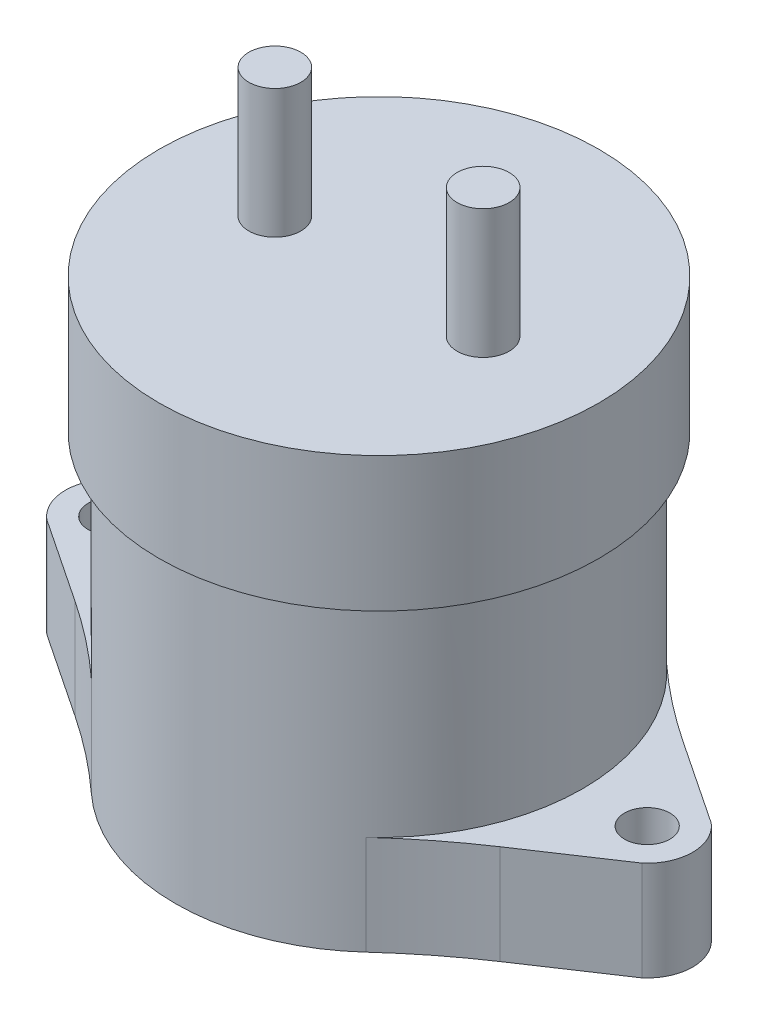
ISO-10303-21;
HEADER;
FILE_DESCRIPTION(('STEP AP214'),'2;1');
FILE_NAME('part.step','',(''),(''),'','','');
FILE_SCHEMA(('AUTOMOTIVE_DESIGN { 1 0 10303 214 1 1 1 1 }'));
ENDSEC;
DATA;
#1=APPLICATION_CONTEXT('core data for automotive mechanical design processes');
#2=APPLICATION_PROTOCOL_DEFINITION('international standard','automotive_design',2000,#1);
#3=PRODUCT_CONTEXT('',#1,'mechanical');
#4=PRODUCT('Part','Part','',(#3));
#5=PRODUCT_RELATED_PRODUCT_CATEGORY('part','',(#4));
#6=PRODUCT_DEFINITION_FORMATION('','',#4);
#7=PRODUCT_DEFINITION_CONTEXT('part definition',#1,'design');
#8=PRODUCT_DEFINITION('design','',#6,#7);
#9=PRODUCT_DEFINITION_SHAPE('','',#8);
#10=(LENGTH_UNIT() NAMED_UNIT(*) SI_UNIT(.MILLI.,.METRE.));
#11=(NAMED_UNIT(*) PLANE_ANGLE_UNIT() SI_UNIT($,.RADIAN.));
#12=(NAMED_UNIT(*) SI_UNIT($,.STERADIAN.) SOLID_ANGLE_UNIT());
#13=UNCERTAINTY_MEASURE_WITH_UNIT(LENGTH_MEASURE(1.E-05),#10,'distance_accuracy_value','');
#14=(GEOMETRIC_REPRESENTATION_CONTEXT(3) GLOBAL_UNCERTAINTY_ASSIGNED_CONTEXT((#13)) GLOBAL_UNIT_ASSIGNED_CONTEXT((#10,
#11,#12)) REPRESENTATION_CONTEXT('',''));
#15=CARTESIAN_POINT('',(0.,0.,0.));
#16=DIRECTION('',(0.,0.,1.));
#17=DIRECTION('',(1.,0.,0.));
#18=AXIS2_PLACEMENT_3D('',#15,#16,#17);
#19=CARTESIAN_POINT('',(0.,14.2,0.));
#20=DIRECTION('',(0.,-1.,0.));
#21=DIRECTION('',(0.,0.,-1.));
#22=AXIS2_PLACEMENT_3D('',#19,#20,#21);
#23=CYLINDRICAL_SURFACE('',#22,26.);
#24=CARTESIAN_POINT('',(0.,12.7,0.));
#25=DIRECTION('',(0.,1.,0.));
#26=DIRECTION('',(0.,0.,1.));
#27=AXIS2_PLACEMENT_3D('',#24,#25,#26);
#28=CIRCLE('',#27,26.);
#29=CARTESIAN_POINT('',(-17.5450875411044,12.7,-19.1877539898495));
#30=VERTEX_POINT('',#29);
#31=CARTESIAN_POINT('',(-17.5450875411043,12.7,19.1877539898495));
#32=VERTEX_POINT('',#31);
#33=EDGE_CURVE('E47',#30,#32,#28,.T.);
#34=ORIENTED_EDGE('',*,*,#33,.T.);
#35=DIRECTION('',(0.,-1.,0.));
#36=VECTOR('',#35,1.);
#37=CARTESIAN_POINT('',(-17.5450875411043,12.7,19.1877539898495));
#38=LINE('',#37,#36);
#39=CARTESIAN_POINT('',(-17.5450875411043,0.,19.1877539898495));
#40=VERTEX_POINT('',#39);
#41=EDGE_CURVE('E215',#32,#40,#38,.T.);
#42=ORIENTED_EDGE('',*,*,#41,.T.);
#43=CARTESIAN_POINT('',(0.,0.,0.));
#44=DIRECTION('',(0.,1.,0.));
#45=DIRECTION('',(0.,0.,1.));
#46=AXIS2_PLACEMENT_3D('',#43,#44,#45);
#47=CIRCLE('',#46,26.);
#48=CARTESIAN_POINT('',(17.5450875411043,0.,19.1877539898495));
#49=VERTEX_POINT('',#48);
#50=EDGE_CURVE('E205',#40,#49,#47,.T.);
#51=ORIENTED_EDGE('',*,*,#50,.T.);
#52=DIRECTION('',(0.,-1.,0.));
#53=VECTOR('',#52,1.);
#54=CARTESIAN_POINT('',(17.5450875411043,12.7,19.1877539898495));
#55=LINE('',#54,#53);
#56=CARTESIAN_POINT('',(17.5450875411044,12.7,19.1877539898495));
#57=VERTEX_POINT('',#56);
#58=EDGE_CURVE('E218',#57,#49,#55,.T.);
#59=ORIENTED_EDGE('',*,*,#58,.F.);
#60=CARTESIAN_POINT('',(17.5450875411044,12.7,-19.1877539898495));
#61=VERTEX_POINT('',#60);
#62=EDGE_CURVE('E11',#57,#61,#28,.T.);
#63=ORIENTED_EDGE('',*,*,#62,.T.);
#64=DIRECTION('',(0.,-1.,0.));
#65=VECTOR('',#64,1.);
#66=CARTESIAN_POINT('',(17.5450875411044,12.7,-19.1877539898495));
#67=LINE('',#66,#65);
#68=CARTESIAN_POINT('',(17.5450875411044,0.,-19.1877539898495));
#69=VERTEX_POINT('',#68);
#70=EDGE_CURVE('E149',#61,#69,#67,.T.);
#71=ORIENTED_EDGE('',*,*,#70,.T.);
#72=CARTESIAN_POINT('',(-17.5450875411044,0.,-19.1877539898495));
#73=VERTEX_POINT('',#72);
#74=EDGE_CURVE('E225',#69,#73,#47,.T.);
#75=ORIENTED_EDGE('',*,*,#74,.T.);
#76=DIRECTION('',(0.,-1.,0.));
#77=VECTOR('',#76,1.);
#78=CARTESIAN_POINT('',(-17.5450875411044,12.7,-19.1877539898495));
#79=LINE('',#78,#77);
#80=EDGE_CURVE('E59',#30,#73,#79,.T.);
#81=ORIENTED_EDGE('',*,*,#80,.F.);
#82=EDGE_LOOP('',(#34,#42,#51,#59,#63,#71,#75,#81));
#83=FACE_BOUND('',#82,.T.);
#84=CARTESIAN_POINT('',(0.,39.2,0.));
#85=DIRECTION('',(0.,1.,0.));
#86=DIRECTION('',(0.,0.,1.));
#87=AXIS2_PLACEMENT_3D('',#84,#85,#86);
#88=CIRCLE('',#87,26.);
#89=CARTESIAN_POINT('',(0.,39.2,26.));
#90=VERTEX_POINT('',#89);
#91=EDGE_CURVE('E318',#90,#90,#88,.T.);
#92=ORIENTED_EDGE('',*,*,#91,.F.);
#93=EDGE_LOOP('',(#92));
#94=FACE_BOUND('',#93,.T.);
#95=ADVANCED_FACE('F40',(#83,#94),#23,.T.);
#96=CARTESIAN_POINT('',(0.,0.,0.));
#97=DIRECTION('',(0.,1.,0.));
#98=DIRECTION('',(0.,0.,1.));
#99=AXIS2_PLACEMENT_3D('',#96,#97,#98);
#100=PLANE('',#99);
#101=ORIENTED_EDGE('',*,*,#74,.F.);
#102=CARTESIAN_POINT('',(71.5299722829639,0.,-78.2269970355402));
#103=DIRECTION('',(0.,1.,0.));
#104=DIRECTION('',(0.,0.,1.));
#105=AXIS2_PLACEMENT_3D('',#102,#103,#104);
#106=CIRCLE('',#105,80.);
#107=CARTESIAN_POINT('',(27.1290840899181,0.,-11.679561865816));
#108=VERTEX_POINT('',#107);
#109=EDGE_CURVE('E180',#69,#108,#106,.T.);
#110=ORIENTED_EDGE('',*,*,#109,.T.);
#111=DIRECTION('',(0.831842939621553,0.,0.555011102413072));
#112=VECTOR('',#111,1.);
#113=CARTESIAN_POINT('',(27.1290840899181,0.,-11.679561865816));
#114=LINE('',#113,#112);
#115=CARTESIAN_POINT('',(37.9900889738865,0.,-4.43302768628988));
#116=VERTEX_POINT('',#115);
#117=EDGE_CURVE('E131',#108,#116,#114,.T.);
#118=ORIENTED_EDGE('',*,*,#117,.T.);
#119=CARTESIAN_POINT('',(34.25,0.,0.));
#120=DIRECTION('',(0.,-1.,0.));
#121=DIRECTION('',(0.,0.,-1.));
#122=AXIS2_PLACEMENT_3D('',#119,#120,#121);
#123=CIRCLE('',#122,5.8);
#124=CARTESIAN_POINT('',(37.9900889738865,0.,4.43302768628989));
#125=VERTEX_POINT('',#124);
#126=EDGE_CURVE('E184',#116,#125,#123,.T.);
#127=ORIENTED_EDGE('',*,*,#126,.T.);
#128=DIRECTION('',(-0.831842939621553,0.,0.555011102413072));
#129=VECTOR('',#128,1.);
#130=CARTESIAN_POINT('',(27.1290840899181,0.,11.679561865816));
#131=LINE('',#130,#129);
#132=CARTESIAN_POINT('',(27.1290840899181,0.,11.679561865816));
#133=VERTEX_POINT('',#132);
#134=EDGE_CURVE('E187',#125,#133,#131,.T.);
#135=ORIENTED_EDGE('',*,*,#134,.T.);
#136=CARTESIAN_POINT('',(71.5299722829638,0.,78.2269970355402));
#137=DIRECTION('',(0.,1.,0.));
#138=DIRECTION('',(0.,0.,-1.));
#139=AXIS2_PLACEMENT_3D('',#136,#137,#138);
#140=CIRCLE('',#139,80.);
#141=EDGE_CURVE('E190',#133,#49,#140,.T.);
#142=ORIENTED_EDGE('',*,*,#141,.T.);
#143=ORIENTED_EDGE('',*,*,#50,.F.);
#144=CARTESIAN_POINT('',(-71.5299722829638,0.,78.2269970355402));
#145=DIRECTION('',(0.,1.,0.));
#146=DIRECTION('',(0.,0.,1.));
#147=AXIS2_PLACEMENT_3D('',#144,#145,#146);
#148=CIRCLE('',#147,80.);
#149=CARTESIAN_POINT('',(-27.1290840899181,0.,11.679561865816));
#150=VERTEX_POINT('',#149);
#151=EDGE_CURVE('E193',#40,#150,#148,.T.);
#152=ORIENTED_EDGE('',*,*,#151,.T.);
#153=DIRECTION('',(-0.831842939621553,0.,-0.555011102413072));
#154=VECTOR('',#153,1.);
#155=CARTESIAN_POINT('',(-27.1290840899181,0.,11.679561865816));
#156=LINE('',#155,#154);
#157=CARTESIAN_POINT('',(-37.9900889738865,0.,4.43302768628989));
#158=VERTEX_POINT('',#157);
#159=EDGE_CURVE('E196',#150,#158,#156,.T.);
#160=ORIENTED_EDGE('',*,*,#159,.T.);
#161=CARTESIAN_POINT('',(-34.25,0.,0.));
#162=DIRECTION('',(0.,-1.,0.));
#163=DIRECTION('',(0.,0.,1.));
#164=AXIS2_PLACEMENT_3D('',#161,#162,#163);
#165=CIRCLE('',#164,5.8);
#166=CARTESIAN_POINT('',(-37.9900889738865,0.,-4.43302768628988));
#167=VERTEX_POINT('',#166);
#168=EDGE_CURVE('E199',#158,#167,#165,.T.);
#169=ORIENTED_EDGE('',*,*,#168,.T.);
#170=DIRECTION('',(0.831842939621553,0.,-0.555011102413072));
#171=VECTOR('',#170,1.);
#172=CARTESIAN_POINT('',(-27.1290840899181,0.,-11.679561865816));
#173=LINE('',#172,#171);
#174=CARTESIAN_POINT('',(-27.1290840899181,0.,-11.679561865816));
#175=VERTEX_POINT('',#174);
#176=EDGE_CURVE('E153',#167,#175,#173,.T.);
#177=ORIENTED_EDGE('',*,*,#176,.T.);
#178=CARTESIAN_POINT('',(-71.5299722829639,0.,-78.2269970355402));
#179=DIRECTION('',(0.,1.,0.));
#180=DIRECTION('',(0.,0.,-1.));
#181=AXIS2_PLACEMENT_3D('',#178,#179,#180);
#182=CIRCLE('',#181,80.);
#183=EDGE_CURVE('E150',#175,#73,#182,.T.);
#184=ORIENTED_EDGE('',*,*,#183,.T.);
#185=EDGE_LOOP('',(#101,#110,#118,#127,#135,#142,#143,#152,#160,#169,#177,#184));
#186=FACE_BOUND('',#185,.T.);
#187=CARTESIAN_POINT('',(-34.25,0.,0.));
#188=DIRECTION('',(0.,-1.,0.));
#189=DIRECTION('',(0.,0.,1.));
#190=AXIS2_PLACEMENT_3D('',#187,#188,#189);
#191=CIRCLE('',#190,2.9);
#192=CARTESIAN_POINT('',(-34.25,0.,2.9));
#193=VERTEX_POINT('',#192);
#194=EDGE_CURVE('E315',#193,#193,#191,.T.);
#195=ORIENTED_EDGE('',*,*,#194,.F.);
#196=EDGE_LOOP('',(#195));
#197=FACE_BOUND('',#196,.T.);
#198=CARTESIAN_POINT('',(34.25,0.,0.));
#199=DIRECTION('',(0.,-1.,0.));
#200=DIRECTION('',(0.,0.,-1.));
#201=AXIS2_PLACEMENT_3D('',#198,#199,#200);
#202=CIRCLE('',#201,2.9);
#203=CARTESIAN_POINT('',(34.25,0.,-2.9));
#204=VERTEX_POINT('',#203);
#205=EDGE_CURVE('E156',#204,#204,#202,.T.);
#206=ORIENTED_EDGE('',*,*,#205,.F.);
#207=EDGE_LOOP('',(#206));
#208=FACE_BOUND('',#207,.T.);
#209=ADVANCED_FACE('F243',(#186,#197,#208),#100,.F.);
#210=CARTESIAN_POINT('',(-27.1290840899181,12.7,-11.679561865816));
#211=DIRECTION('',(-0.555011102413072,0.,-0.831842939621553));
#212=DIRECTION('',(-0.831842939621553,0.,0.555011102413072));
#213=AXIS2_PLACEMENT_3D('',#210,#211,#212);
#214=PLANE('',#213);
#215=ORIENTED_EDGE('',*,*,#176,.F.);
#216=DIRECTION('',(0.,-1.,0.));
#217=VECTOR('',#216,1.);
#218=CARTESIAN_POINT('',(-37.9900889738865,12.7,-4.43302768628988));
#219=LINE('',#218,#217);
#220=CARTESIAN_POINT('',(-37.9900889738865,12.7,-4.43302768628988));
#221=VERTEX_POINT('',#220);
#222=EDGE_CURVE('E209',#221,#167,#219,.T.);
#223=ORIENTED_EDGE('',*,*,#222,.F.);
#224=DIRECTION('',(0.831842939621553,0.,-0.555011102413072));
#225=VECTOR('',#224,1.);
#226=CARTESIAN_POINT('',(-27.1290840899181,12.7,-11.679561865816));
#227=LINE('',#226,#225);
#228=CARTESIAN_POINT('',(-27.1290840899181,12.7,-11.679561865816));
#229=VERTEX_POINT('',#228);
#230=EDGE_CURVE('E175',#221,#229,#227,.T.);
#231=ORIENTED_EDGE('',*,*,#230,.T.);
#232=DIRECTION('',(0.,-1.,0.));
#233=VECTOR('',#232,1.);
#234=CARTESIAN_POINT('',(-27.1290840899181,12.7,-11.679561865816));
#235=LINE('',#234,#233);
#236=EDGE_CURVE('E207',#229,#175,#235,.T.);
#237=ORIENTED_EDGE('',*,*,#236,.T.);
#238=EDGE_LOOP('',(#215,#223,#231,#237));
#239=FACE_BOUND('',#238,.T.);
#240=ADVANCED_FACE('F260',(#239),#214,.T.);
#241=CARTESIAN_POINT('',(-34.25,12.7,0.));
#242=DIRECTION('',(0.,-1.,0.));
#243=DIRECTION('',(0.,0.,-1.));
#244=AXIS2_PLACEMENT_3D('',#241,#242,#243);
#245=CYLINDRICAL_SURFACE('',#244,5.8);
#246=ORIENTED_EDGE('',*,*,#168,.F.);
#247=DIRECTION('',(0.,-1.,0.));
#248=VECTOR('',#247,1.);
#249=CARTESIAN_POINT('',(-37.9900889738865,12.7,4.43302768628989));
#250=LINE('',#249,#248);
#251=CARTESIAN_POINT('',(-37.9900889738865,12.7,4.43302768628989));
#252=VERTEX_POINT('',#251);
#253=EDGE_CURVE('E211',#252,#158,#250,.T.);
#254=ORIENTED_EDGE('',*,*,#253,.F.);
#255=CARTESIAN_POINT('',(-34.25,12.7,0.));
#256=DIRECTION('',(0.,-1.,0.));
#257=DIRECTION('',(0.,0.,1.));
#258=AXIS2_PLACEMENT_3D('',#255,#256,#257);
#259=CIRCLE('',#258,5.8);
#260=EDGE_CURVE('E172',#252,#221,#259,.T.);
#261=ORIENTED_EDGE('',*,*,#260,.T.);
#262=ORIENTED_EDGE('',*,*,#222,.T.);
#263=EDGE_LOOP('',(#246,#254,#261,#262));
#264=FACE_BOUND('',#263,.T.);
#265=ADVANCED_FACE('F262',(#264),#245,.T.);
#266=CARTESIAN_POINT('',(-27.1290840899181,12.7,11.679561865816));
#267=DIRECTION('',(-0.555011102413072,0.,0.831842939621553));
#268=DIRECTION('',(0.831842939621553,0.,0.555011102413072));
#269=AXIS2_PLACEMENT_3D('',#266,#267,#268);
#270=PLANE('',#269);
#271=ORIENTED_EDGE('',*,*,#159,.F.);
#272=DIRECTION('',(0.,-1.,0.));
#273=VECTOR('',#272,1.);
#274=CARTESIAN_POINT('',(-27.1290840899181,12.7,11.679561865816));
#275=LINE('',#274,#273);
#276=CARTESIAN_POINT('',(-27.1290840899181,12.7,11.679561865816));
#277=VERTEX_POINT('',#276);
#278=EDGE_CURVE('E213',#277,#150,#275,.T.);
#279=ORIENTED_EDGE('',*,*,#278,.F.);
#280=DIRECTION('',(-0.831842939621553,0.,-0.555011102413072));
#281=VECTOR('',#280,1.);
#282=CARTESIAN_POINT('',(-27.1290840899181,12.7,11.679561865816));
#283=LINE('',#282,#281);
#284=EDGE_CURVE('E169',#277,#252,#283,.T.);
#285=ORIENTED_EDGE('',*,*,#284,.T.);
#286=ORIENTED_EDGE('',*,*,#253,.T.);
#287=EDGE_LOOP('',(#271,#279,#285,#286));
#288=FACE_BOUND('',#287,.T.);
#289=ADVANCED_FACE('F240',(#288),#270,.T.);
#290=CARTESIAN_POINT('',(-34.25,12.7,0.));
#291=DIRECTION('',(0.,-1.,0.));
#292=DIRECTION('',(0.,0.,-1.));
#293=AXIS2_PLACEMENT_3D('',#290,#291,#292);
#294=CYLINDRICAL_SURFACE('',#293,2.9);
#295=CARTESIAN_POINT('',(-34.25,12.7,0.));
#296=DIRECTION('',(0.,-1.,0.));
#297=DIRECTION('',(0.,0.,1.));
#298=AXIS2_PLACEMENT_3D('',#295,#296,#297);
#299=CIRCLE('',#298,2.9);
#300=CARTESIAN_POINT('',(-34.25,12.7,2.9));
#301=VERTEX_POINT('',#300);
#302=EDGE_CURVE('E313',#301,#301,#299,.T.);
#303=ORIENTED_EDGE('',*,*,#302,.F.);
#304=EDGE_LOOP('',(#303));
#305=FACE_BOUND('',#304,.T.);
#306=ORIENTED_EDGE('',*,*,#194,.T.);
#307=EDGE_LOOP('',(#306));
#308=FACE_BOUND('',#307,.T.);
#309=ADVANCED_FACE('F269',(#305,#308),#294,.F.);
#310=CARTESIAN_POINT('',(71.5299722829639,12.7,-78.2269970355402));
#311=DIRECTION('',(0.,1.,0.));
#312=DIRECTION('',(0.,0.,1.));
#313=AXIS2_PLACEMENT_3D('',#310,#311,#312);
#314=PLANE('',#313);
#315=ORIENTED_EDGE('',*,*,#302,.T.);
#316=EDGE_LOOP('',(#315));
#317=FACE_BOUND('',#316,.T.);
#318=ORIENTED_EDGE('',*,*,#33,.F.);
#319=CARTESIAN_POINT('',(-71.5299722829639,12.7,-78.2269970355402));
#320=DIRECTION('',(0.,1.,0.));
#321=DIRECTION('',(0.,0.,-1.));
#322=AXIS2_PLACEMENT_3D('',#319,#320,#321);
#323=CIRCLE('',#322,80.);
#324=EDGE_CURVE('E137',#229,#30,#323,.T.);
#325=ORIENTED_EDGE('',*,*,#324,.F.);
#326=ORIENTED_EDGE('',*,*,#230,.F.);
#327=ORIENTED_EDGE('',*,*,#260,.F.);
#328=ORIENTED_EDGE('',*,*,#284,.F.);
#329=CARTESIAN_POINT('',(-71.5299722829638,12.7,78.2269970355402));
#330=DIRECTION('',(0.,1.,0.));
#331=DIRECTION('',(0.,0.,1.));
#332=AXIS2_PLACEMENT_3D('',#329,#330,#331);
#333=CIRCLE('',#332,80.);
#334=EDGE_CURVE('E166',#32,#277,#333,.T.);
#335=ORIENTED_EDGE('',*,*,#334,.F.);
#336=EDGE_LOOP('',(#318,#325,#326,#327,#328,#335));
#337=FACE_BOUND('',#336,.T.);
#338=ADVANCED_FACE('F235',(#317,#337),#314,.T.);
#339=CARTESIAN_POINT('',(-71.5299722829638,12.7,78.2269970355402));
#340=DIRECTION('',(0.,-1.,0.));
#341=DIRECTION('',(0.,0.,-1.));
#342=AXIS2_PLACEMENT_3D('',#339,#340,#341);
#343=CYLINDRICAL_SURFACE('',#342,80.);
#344=ORIENTED_EDGE('',*,*,#151,.F.);
#345=ORIENTED_EDGE('',*,*,#41,.F.);
#346=ORIENTED_EDGE('',*,*,#334,.T.);
#347=ORIENTED_EDGE('',*,*,#278,.T.);
#348=EDGE_LOOP('',(#344,#345,#346,#347));
#349=FACE_BOUND('',#348,.T.);
#350=ADVANCED_FACE('F233',(#349),#343,.F.);
#351=CARTESIAN_POINT('',(-71.5299722829639,12.7,-78.2269970355402));
#352=DIRECTION('',(0.,-1.,0.));
#353=DIRECTION('',(0.,0.,-1.));
#354=AXIS2_PLACEMENT_3D('',#351,#352,#353);
#355=CYLINDRICAL_SURFACE('',#354,80.);
#356=ORIENTED_EDGE('',*,*,#183,.F.);
#357=ORIENTED_EDGE('',*,*,#236,.F.);
#358=ORIENTED_EDGE('',*,*,#324,.T.);
#359=ORIENTED_EDGE('',*,*,#80,.T.);
#360=EDGE_LOOP('',(#356,#357,#358,#359));
#361=FACE_BOUND('',#360,.T.);
#362=ADVANCED_FACE('F258',(#361),#355,.F.);
#363=CARTESIAN_POINT('',(34.25,12.7,0.));
#364=DIRECTION('',(0.,-1.,0.));
#365=DIRECTION('',(0.,0.,-1.));
#366=AXIS2_PLACEMENT_3D('',#363,#364,#365);
#367=CIRCLE('',#366,2.9);
#368=CARTESIAN_POINT('',(34.25,12.7,-2.9));
#369=VERTEX_POINT('',#368);
#370=EDGE_CURVE('E182',#369,#369,#367,.T.);
#371=ORIENTED_EDGE('',*,*,#370,.T.);
#372=EDGE_LOOP('',(#371));
#373=FACE_BOUND('',#372,.T.);
#374=ORIENTED_EDGE('',*,*,#62,.F.);
#375=CARTESIAN_POINT('',(71.5299722829638,12.7,78.2269970355402));
#376=DIRECTION('',(0.,1.,0.));
#377=DIRECTION('',(0.,0.,-1.));
#378=AXIS2_PLACEMENT_3D('',#375,#376,#377);
#379=CIRCLE('',#378,80.);
#380=CARTESIAN_POINT('',(27.1290840899181,12.7,11.679561865816));
#381=VERTEX_POINT('',#380);
#382=EDGE_CURVE('E163',#381,#57,#379,.T.);
#383=ORIENTED_EDGE('',*,*,#382,.F.);
#384=DIRECTION('',(-0.831842939621553,0.,0.555011102413072));
#385=VECTOR('',#384,1.);
#386=CARTESIAN_POINT('',(27.1290840899181,12.7,11.679561865816));
#387=LINE('',#386,#385);
#388=CARTESIAN_POINT('',(37.9900889738865,12.7,4.43302768628989));
#389=VERTEX_POINT('',#388);
#390=EDGE_CURVE('E160',#389,#381,#387,.T.);
#391=ORIENTED_EDGE('',*,*,#390,.F.);
#392=CARTESIAN_POINT('',(34.25,12.7,0.));
#393=DIRECTION('',(0.,-1.,0.));
#394=DIRECTION('',(0.,0.,-1.));
#395=AXIS2_PLACEMENT_3D('',#392,#393,#394);
#396=CIRCLE('',#395,5.8);
#397=CARTESIAN_POINT('',(37.9900889738865,12.7,-4.43302768628988));
#398=VERTEX_POINT('',#397);
#399=EDGE_CURVE('E146',#398,#389,#396,.T.);
#400=ORIENTED_EDGE('',*,*,#399,.F.);
#401=DIRECTION('',(0.831842939621553,0.,0.555011102413072));
#402=VECTOR('',#401,1.);
#403=CARTESIAN_POINT('',(27.1290840899181,12.7,-11.679561865816));
#404=LINE('',#403,#402);
#405=CARTESIAN_POINT('',(27.1290840899181,12.7,-11.679561865816));
#406=VERTEX_POINT('',#405);
#407=EDGE_CURVE('E129',#406,#398,#404,.T.);
#408=ORIENTED_EDGE('',*,*,#407,.F.);
#409=CARTESIAN_POINT('',(71.5299722829639,12.7,-78.2269970355402));
#410=DIRECTION('',(0.,1.,0.));
#411=DIRECTION('',(0.,0.,1.));
#412=AXIS2_PLACEMENT_3D('',#409,#410,#411);
#413=CIRCLE('',#412,80.);
#414=EDGE_CURVE('E143',#61,#406,#413,.T.);
#415=ORIENTED_EDGE('',*,*,#414,.F.);
#416=EDGE_LOOP('',(#374,#383,#391,#400,#408,#415));
#417=FACE_BOUND('',#416,.T.);
#418=ADVANCED_FACE('F142',(#373,#417),#314,.T.);
#419=CARTESIAN_POINT('',(71.5299722829639,12.7,-78.2269970355402));
#420=DIRECTION('',(0.,-1.,0.));
#421=DIRECTION('',(0.,0.,-1.));
#422=AXIS2_PLACEMENT_3D('',#419,#420,#421);
#423=CYLINDRICAL_SURFACE('',#422,80.);
#424=ORIENTED_EDGE('',*,*,#109,.F.);
#425=ORIENTED_EDGE('',*,*,#70,.F.);
#426=ORIENTED_EDGE('',*,*,#414,.T.);
#427=DIRECTION('',(0.,-1.,0.));
#428=VECTOR('',#427,1.);
#429=CARTESIAN_POINT('',(27.1290840899181,12.7,-11.679561865816));
#430=LINE('',#429,#428);
#431=EDGE_CURVE('E126',#406,#108,#430,.T.);
#432=ORIENTED_EDGE('',*,*,#431,.T.);
#433=EDGE_LOOP('',(#424,#425,#426,#432));
#434=FACE_BOUND('',#433,.T.);
#435=ADVANCED_FACE('F148',(#434),#423,.F.);
#436=CARTESIAN_POINT('',(71.5299722829638,12.7,78.2269970355402));
#437=DIRECTION('',(0.,-1.,0.));
#438=DIRECTION('',(0.,0.,-1.));
#439=AXIS2_PLACEMENT_3D('',#436,#437,#438);
#440=CYLINDRICAL_SURFACE('',#439,80.);
#441=ORIENTED_EDGE('',*,*,#141,.F.);
#442=DIRECTION('',(0.,-1.,0.));
#443=VECTOR('',#442,1.);
#444=CARTESIAN_POINT('',(27.1290840899181,12.7,11.679561865816));
#445=LINE('',#444,#443);
#446=EDGE_CURVE('E221',#381,#133,#445,.T.);
#447=ORIENTED_EDGE('',*,*,#446,.F.);
#448=ORIENTED_EDGE('',*,*,#382,.T.);
#449=ORIENTED_EDGE('',*,*,#58,.T.);
#450=EDGE_LOOP('',(#441,#447,#448,#449));
#451=FACE_BOUND('',#450,.T.);
#452=ADVANCED_FACE('F248',(#451),#440,.F.);
#453=CARTESIAN_POINT('',(27.1290840899181,12.7,11.679561865816));
#454=DIRECTION('',(0.555011102413072,0.,0.831842939621553));
#455=DIRECTION('',(0.831842939621553,0.,-0.555011102413072));
#456=AXIS2_PLACEMENT_3D('',#453,#454,#455);
#457=PLANE('',#456);
#458=ORIENTED_EDGE('',*,*,#134,.F.);
#459=DIRECTION('',(0.,-1.,0.));
#460=VECTOR('',#459,1.);
#461=CARTESIAN_POINT('',(37.9900889738865,12.7,4.43302768628989));
#462=LINE('',#461,#460);
#463=EDGE_CURVE('E223',#389,#125,#462,.T.);
#464=ORIENTED_EDGE('',*,*,#463,.F.);
#465=ORIENTED_EDGE('',*,*,#390,.T.);
#466=ORIENTED_EDGE('',*,*,#446,.T.);
#467=EDGE_LOOP('',(#458,#464,#465,#466));
#468=FACE_BOUND('',#467,.T.);
#469=ADVANCED_FACE('F251',(#468),#457,.T.);
#470=CARTESIAN_POINT('',(34.25,12.7,0.));
#471=DIRECTION('',(0.,-1.,0.));
#472=DIRECTION('',(0.,0.,-1.));
#473=AXIS2_PLACEMENT_3D('',#470,#471,#472);
#474=CYLINDRICAL_SURFACE('',#473,5.8);
#475=ORIENTED_EDGE('',*,*,#126,.F.);
#476=DIRECTION('',(0.,-1.,0.));
#477=VECTOR('',#476,1.);
#478=CARTESIAN_POINT('',(37.9900889738865,12.7,-4.43302768628988));
#479=LINE('',#478,#477);
#480=EDGE_CURVE('E136',#398,#116,#479,.T.);
#481=ORIENTED_EDGE('',*,*,#480,.F.);
#482=ORIENTED_EDGE('',*,*,#399,.T.);
#483=ORIENTED_EDGE('',*,*,#463,.T.);
#484=EDGE_LOOP('',(#475,#481,#482,#483));
#485=FACE_BOUND('',#484,.T.);
#486=ADVANCED_FACE('F254',(#485),#474,.T.);
#487=CARTESIAN_POINT('',(27.1290840899181,12.7,-11.679561865816));
#488=DIRECTION('',(0.555011102413072,0.,-0.831842939621553));
#489=DIRECTION('',(-0.831842939621553,0.,-0.555011102413072));
#490=AXIS2_PLACEMENT_3D('',#487,#488,#489);
#491=PLANE('',#490);
#492=ORIENTED_EDGE('',*,*,#117,.F.);
#493=ORIENTED_EDGE('',*,*,#431,.F.);
#494=ORIENTED_EDGE('',*,*,#407,.T.);
#495=ORIENTED_EDGE('',*,*,#480,.T.);
#496=EDGE_LOOP('',(#492,#493,#494,#495));
#497=FACE_BOUND('',#496,.T.);
#498=ADVANCED_FACE('F128',(#497),#491,.T.);
#499=CARTESIAN_POINT('',(34.25,12.7,0.));
#500=DIRECTION('',(0.,-1.,0.));
#501=DIRECTION('',(0.,0.,-1.));
#502=AXIS2_PLACEMENT_3D('',#499,#500,#501);
#503=CYLINDRICAL_SURFACE('',#502,2.9);
#504=ORIENTED_EDGE('',*,*,#370,.F.);
#505=EDGE_LOOP('',(#504));
#506=FACE_BOUND('',#505,.T.);
#507=ORIENTED_EDGE('',*,*,#205,.T.);
#508=EDGE_LOOP('',(#507));
#509=FACE_BOUND('',#508,.T.);
#510=ADVANCED_FACE('F283',(#506,#509),#503,.F.);
#511=CARTESIAN_POINT('',(0.,56.4,0.));
#512=DIRECTION('',(0.,-1.,0.));
#513=DIRECTION('',(0.,0.,-1.));
#514=AXIS2_PLACEMENT_3D('',#511,#512,#513);
#515=CYLINDRICAL_SURFACE('',#514,28.075);
#516=CARTESIAN_POINT('',(0.,56.4,0.));
#517=DIRECTION('',(0.,1.,0.));
#518=DIRECTION('',(0.,0.,1.));
#519=AXIS2_PLACEMENT_3D('',#516,#517,#518);
#520=CIRCLE('',#519,28.075);
#521=CARTESIAN_POINT('',(0.,56.4,28.075));
#522=VERTEX_POINT('',#521);
#523=EDGE_CURVE('E322',#522,#522,#520,.T.);
#524=ORIENTED_EDGE('',*,*,#523,.F.);
#525=EDGE_LOOP('',(#524));
#526=FACE_BOUND('',#525,.T.);
#527=CARTESIAN_POINT('',(0.,39.2,0.));
#528=DIRECTION('',(0.,1.,0.));
#529=DIRECTION('',(0.,0.,1.));
#530=AXIS2_PLACEMENT_3D('',#527,#528,#529);
#531=CIRCLE('',#530,28.075);
#532=CARTESIAN_POINT('',(0.,39.2,28.075));
#533=VERTEX_POINT('',#532);
#534=EDGE_CURVE('E323',#533,#533,#531,.T.);
#535=ORIENTED_EDGE('',*,*,#534,.T.);
#536=EDGE_LOOP('',(#535));
#537=FACE_BOUND('',#536,.T.);
#538=ADVANCED_FACE('F347',(#526,#537),#515,.T.);
#539=CARTESIAN_POINT('',(0.,56.4,0.));
#540=DIRECTION('',(0.,1.,0.));
#541=DIRECTION('',(0.,0.,1.));
#542=AXIS2_PLACEMENT_3D('',#539,#540,#541);
#543=PLANE('',#542);
#544=CARTESIAN_POINT('',(-13.3,56.4,0.));
#545=DIRECTION('',(0.,1.,0.));
#546=DIRECTION('',(0.,0.,-1.));
#547=AXIS2_PLACEMENT_3D('',#544,#545,#546);
#548=CIRCLE('',#547,3.325);
#549=CARTESIAN_POINT('',(-13.3,56.4,-3.325));
#550=VERTEX_POINT('',#549);
#551=EDGE_CURVE('E332',#550,#550,#548,.T.);
#552=ORIENTED_EDGE('',*,*,#551,.F.);
#553=EDGE_LOOP('',(#552));
#554=FACE_BOUND('',#553,.T.);
#555=CARTESIAN_POINT('',(13.3,56.4,0.));
#556=DIRECTION('',(0.,1.,0.));
#557=DIRECTION('',(0.,0.,1.));
#558=AXIS2_PLACEMENT_3D('',#555,#556,#557);
#559=CIRCLE('',#558,3.325);
#560=CARTESIAN_POINT('',(13.3,56.4,3.325));
#561=VERTEX_POINT('',#560);
#562=EDGE_CURVE('E329',#561,#561,#559,.T.);
#563=ORIENTED_EDGE('',*,*,#562,.F.);
#564=EDGE_LOOP('',(#563));
#565=FACE_BOUND('',#564,.T.);
#566=ORIENTED_EDGE('',*,*,#523,.T.);
#567=EDGE_LOOP('',(#566));
#568=FACE_BOUND('',#567,.T.);
#569=ADVANCED_FACE('F343',(#554,#565,#568),#543,.T.);
#570=CARTESIAN_POINT('',(0.,39.2,0.));
#571=DIRECTION('',(0.,1.,0.));
#572=DIRECTION('',(0.,0.,1.));
#573=AXIS2_PLACEMENT_3D('',#570,#571,#572);
#574=PLANE('',#573);
#575=ORIENTED_EDGE('',*,*,#91,.T.);
#576=EDGE_LOOP('',(#575));
#577=FACE_BOUND('',#576,.T.);
#578=ORIENTED_EDGE('',*,*,#534,.F.);
#579=EDGE_LOOP('',(#578));
#580=FACE_BOUND('',#579,.T.);
#581=ADVANCED_FACE('F346',(#577,#580),#574,.F.);
#582=CARTESIAN_POINT('',(13.3,72.85,0.));
#583=DIRECTION('',(0.,-1.,0.));
#584=DIRECTION('',(0.,0.,-1.));
#585=AXIS2_PLACEMENT_3D('',#582,#583,#584);
#586=CYLINDRICAL_SURFACE('',#585,3.325);
#587=CARTESIAN_POINT('',(13.3,72.85,0.));
#588=DIRECTION('',(0.,1.,0.));
#589=DIRECTION('',(0.,0.,1.));
#590=AXIS2_PLACEMENT_3D('',#587,#588,#589);
#591=CIRCLE('',#590,3.325);
#592=CARTESIAN_POINT('',(13.3,72.85,3.325));
#593=VERTEX_POINT('',#592);
#594=EDGE_CURVE('E326',#593,#593,#591,.T.);
#595=ORIENTED_EDGE('',*,*,#594,.F.);
#596=EDGE_LOOP('',(#595));
#597=FACE_BOUND('',#596,.T.);
#598=ORIENTED_EDGE('',*,*,#562,.T.);
#599=EDGE_LOOP('',(#598));
#600=FACE_BOUND('',#599,.T.);
#601=ADVANCED_FACE('F359',(#597,#600),#586,.T.);
#602=CARTESIAN_POINT('',(13.3,72.85,0.));
#603=DIRECTION('',(0.,1.,0.));
#604=DIRECTION('',(0.,0.,1.));
#605=AXIS2_PLACEMENT_3D('',#602,#603,#604);
#606=PLANE('',#605);
#607=ORIENTED_EDGE('',*,*,#594,.T.);
#608=EDGE_LOOP('',(#607));
#609=FACE_BOUND('',#608,.T.);
#610=ADVANCED_FACE('F365',(#609),#606,.T.);
#611=CARTESIAN_POINT('',(-13.3,72.85,0.));
#612=DIRECTION('',(0.,-1.,0.));
#613=DIRECTION('',(0.,0.,-1.));
#614=AXIS2_PLACEMENT_3D('',#611,#612,#613);
#615=CYLINDRICAL_SURFACE('',#614,3.325);
#616=CARTESIAN_POINT('',(-13.3,72.85,0.));
#617=DIRECTION('',(0.,1.,0.));
#618=DIRECTION('',(0.,0.,-1.));
#619=AXIS2_PLACEMENT_3D('',#616,#617,#618);
#620=CIRCLE('',#619,3.325);
#621=CARTESIAN_POINT('',(-13.3,72.85,-3.325));
#622=VERTEX_POINT('',#621);
#623=EDGE_CURVE('E335',#622,#622,#620,.T.);
#624=ORIENTED_EDGE('',*,*,#623,.F.);
#625=EDGE_LOOP('',(#624));
#626=FACE_BOUND('',#625,.T.);
#627=ORIENTED_EDGE('',*,*,#551,.T.);
#628=EDGE_LOOP('',(#627));
#629=FACE_BOUND('',#628,.T.);
#630=ADVANCED_FACE('F341',(#626,#629),#615,.T.);
#631=CARTESIAN_POINT('',(-13.3,72.85,0.));
#632=DIRECTION('',(0.,-1.,0.));
#633=DIRECTION('',(0.,0.,-1.));
#634=AXIS2_PLACEMENT_3D('',#631,#632,#633);
#635=PLANE('',#634);
#636=ORIENTED_EDGE('',*,*,#623,.T.);
#637=EDGE_LOOP('',(#636));
#638=FACE_BOUND('',#637,.T.);
#639=ADVANCED_FACE('F413',(#638),#635,.F.);
#640=CLOSED_SHELL('',(#95,#209,#240,#265,#289,#309,#338,#350,#362,#418,#435,#452,#469,#486,#498,
#510,#538,#569,#581,#601,#610,#630,#639));
#641=MANIFOLD_SOLID_BREP('B2',#640);
#642=ADVANCED_BREP_SHAPE_REPRESENTATION('',(#18,#641),#14);
#643=SHAPE_DEFINITION_REPRESENTATION(#9,#642);
ENDSEC;
END-ISO-10303-21;
